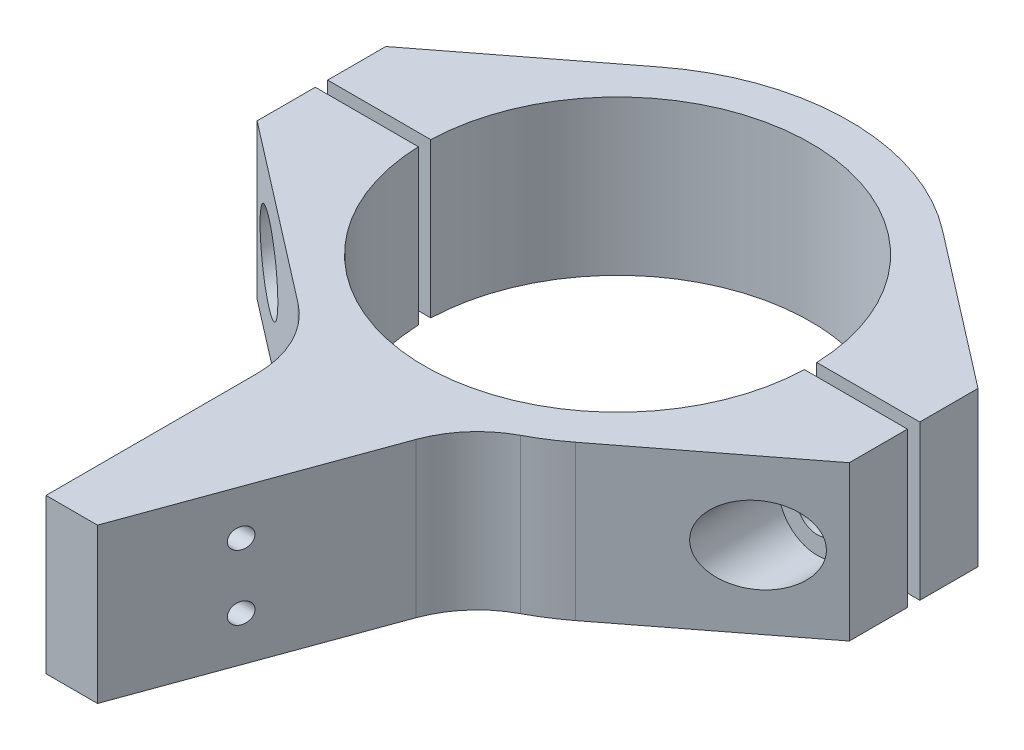
ISO-10303-21;
HEADER;
FILE_DESCRIPTION(('STEP AP214'),'2;1');
FILE_NAME('part.step','',(''),(''),'','','');
FILE_SCHEMA(('AUTOMOTIVE_DESIGN { 1 0 10303 214 1 1 1 1 }'));
ENDSEC;
DATA;
#1=APPLICATION_CONTEXT('core data for automotive mechanical design processes');
#2=APPLICATION_PROTOCOL_DEFINITION('international standard','automotive_design',2000,#1);
#3=PRODUCT_CONTEXT('',#1,'mechanical');
#4=PRODUCT('Part','Part','',(#3));
#5=PRODUCT_RELATED_PRODUCT_CATEGORY('part','',(#4));
#6=PRODUCT_DEFINITION_FORMATION('','',#4);
#7=PRODUCT_DEFINITION_CONTEXT('part definition',#1,'design');
#8=PRODUCT_DEFINITION('design','',#6,#7);
#9=PRODUCT_DEFINITION_SHAPE('','',#8);
#10=(LENGTH_UNIT() NAMED_UNIT(*) SI_UNIT(.MILLI.,.METRE.));
#11=(NAMED_UNIT(*) PLANE_ANGLE_UNIT() SI_UNIT($,.RADIAN.));
#12=(NAMED_UNIT(*) SI_UNIT($,.STERADIAN.) SOLID_ANGLE_UNIT());
#13=UNCERTAINTY_MEASURE_WITH_UNIT(LENGTH_MEASURE(1.E-05),#10,'distance_accuracy_value','');
#14=(GEOMETRIC_REPRESENTATION_CONTEXT(3) GLOBAL_UNCERTAINTY_ASSIGNED_CONTEXT((#13)) GLOBAL_UNIT_ASSIGNED_CONTEXT((#10,
#11,#12)) REPRESENTATION_CONTEXT('',''));
#15=CARTESIAN_POINT('',(0.,0.,0.));
#16=DIRECTION('',(0.,0.,1.));
#17=DIRECTION('',(1.,0.,0.));
#18=AXIS2_PLACEMENT_3D('',#15,#16,#17);
#19=CARTESIAN_POINT('',(0.,9.525,0.));
#20=DIRECTION('',(0.,1.,0.));
#21=DIRECTION('',(0.,0.,1.));
#22=AXIS2_PLACEMENT_3D('',#19,#20,#21);
#23=PLANE('',#22);
#24=DIRECTION('',(-1.,0.,0.));
#25=VECTOR('',#24,1.);
#26=CARTESIAN_POINT('',(0.,9.525,-0.762));
#27=LINE('',#26,#25);
#28=CARTESIAN_POINT('',(36.5125,9.52499999999999,-0.762));
#29=VERTEX_POINT('',#28);
#30=CARTESIAN_POINT('',(23.8003048772489,9.525,-0.762));
#31=VERTEX_POINT('',#30);
#32=EDGE_CURVE('E89',#29,#31,#27,.T.);
#33=ORIENTED_EDGE('',*,*,#32,.F.);
#34=DIRECTION('',(0.,0.,-1.));
#35=VECTOR('',#34,1.);
#36=CARTESIAN_POINT('',(36.5125,9.525,-7.9375));
#37=LINE('',#36,#35);
#38=CARTESIAN_POINT('',(36.5125,9.525,-7.9375));
#39=VERTEX_POINT('',#38);
#40=EDGE_CURVE('E158',#29,#39,#37,.T.);
#41=ORIENTED_EDGE('',*,*,#40,.T.);
#42=DIRECTION('',(-0.792079910516916,0.,-0.610417410757192));
#43=VECTOR('',#42,1.);
#44=CARTESIAN_POINT('',(17.4426775123868,9.525,-22.6336834430209));
#45=LINE('',#44,#43);
#46=CARTESIAN_POINT('',(17.4426775123868,9.525,-22.6336834430209));
#47=VERTEX_POINT('',#46);
#48=EDGE_CURVE('E159',#39,#47,#45,.T.);
#49=ORIENTED_EDGE('',*,*,#48,.T.);
#50=CARTESIAN_POINT('',(0.,9.525,0.));
#51=DIRECTION('',(0.,1.,0.));
#52=DIRECTION('',(0.,0.,1.));
#53=AXIS2_PLACEMENT_3D('',#50,#51,#52);
#54=CIRCLE('',#53,28.575);
#55=CARTESIAN_POINT('',(-17.4426775123868,9.525,-22.6336834430209));
#56=VERTEX_POINT('',#55);
#57=EDGE_CURVE('E165',#47,#56,#54,.T.);
#58=ORIENTED_EDGE('',*,*,#57,.T.);
#59=DIRECTION('',(-0.792079910516916,0.,0.610417410757192));
#60=VECTOR('',#59,1.);
#61=CARTESIAN_POINT('',(-17.4426775123868,9.525,-22.6336834430209));
#62=LINE('',#61,#60);
#63=CARTESIAN_POINT('',(-36.5125,9.525,-7.9375));
#64=VERTEX_POINT('',#63);
#65=EDGE_CURVE('E157',#56,#64,#62,.T.);
#66=ORIENTED_EDGE('',*,*,#65,.T.);
#67=DIRECTION('',(0.,0.,1.));
#68=VECTOR('',#67,1.);
#69=CARTESIAN_POINT('',(-36.5125,9.525,-7.9375));
#70=LINE('',#69,#68);
#71=CARTESIAN_POINT('',(-36.5125,9.525,-0.762));
#72=VERTEX_POINT('',#71);
#73=EDGE_CURVE('E156',#64,#72,#70,.T.);
#74=ORIENTED_EDGE('',*,*,#73,.T.);
#75=CARTESIAN_POINT('',(-23.8003048772489,9.525,-0.762));
#76=VERTEX_POINT('',#75);
#77=EDGE_CURVE('E121',#76,#72,#27,.T.);
#78=ORIENTED_EDGE('',*,*,#77,.F.);
#79=CARTESIAN_POINT('',(0.,9.525,0.));
#80=DIRECTION('',(0.,1.,0.));
#81=DIRECTION('',(0.,0.,1.));
#82=AXIS2_PLACEMENT_3D('',#79,#80,#81);
#83=CIRCLE('',#82,23.8125);
#84=EDGE_CURVE('E177',#31,#76,#83,.T.);
#85=ORIENTED_EDGE('',*,*,#84,.F.);
#86=EDGE_LOOP('',(#33,#41,#49,#58,#66,#74,#78,#85));
#87=FACE_BOUND('',#86,.T.);
#88=ADVANCED_FACE('F59',(#87),#23,.T.);
#89=CARTESIAN_POINT('',(0.,-9.525,0.));
#90=DIRECTION('',(0.,1.,0.));
#91=DIRECTION('',(0.,0.,1.));
#92=AXIS2_PLACEMENT_3D('',#89,#90,#91);
#93=PLANE('',#92);
#94=DIRECTION('',(0.,0.,1.));
#95=VECTOR('',#94,1.);
#96=CARTESIAN_POINT('',(36.5125,-9.525,-7.9375));
#97=LINE('',#96,#95);
#98=CARTESIAN_POINT('',(36.5125,-9.525,-7.9375));
#99=VERTEX_POINT('',#98);
#100=CARTESIAN_POINT('',(36.5125,-9.525,-0.762000000000001));
#101=VERTEX_POINT('',#100);
#102=EDGE_CURVE('E62',#99,#101,#97,.T.);
#103=ORIENTED_EDGE('',*,*,#102,.T.);
#104=DIRECTION('',(-1.,0.,0.));
#105=VECTOR('',#104,1.);
#106=CARTESIAN_POINT('',(-36.5125,-9.525,-0.762));
#107=LINE('',#106,#105);
#108=CARTESIAN_POINT('',(23.8003048772489,-9.525,-0.762));
#109=VERTEX_POINT('',#108);
#110=EDGE_CURVE('E145',#101,#109,#107,.T.);
#111=ORIENTED_EDGE('',*,*,#110,.T.);
#112=CARTESIAN_POINT('',(0.,-9.525,0.));
#113=DIRECTION('',(0.,1.,0.));
#114=DIRECTION('',(0.,0.,1.));
#115=AXIS2_PLACEMENT_3D('',#112,#113,#114);
#116=CIRCLE('',#115,23.8125);
#117=CARTESIAN_POINT('',(-23.8003048772489,-9.525,-0.762));
#118=VERTEX_POINT('',#117);
#119=EDGE_CURVE('E143',#109,#118,#116,.T.);
#120=ORIENTED_EDGE('',*,*,#119,.T.);
#121=CARTESIAN_POINT('',(-36.5125,-9.525,-0.762));
#122=VERTEX_POINT('',#121);
#123=EDGE_CURVE('E126',#118,#122,#107,.T.);
#124=ORIENTED_EDGE('',*,*,#123,.T.);
#125=DIRECTION('',(0.,0.,-1.));
#126=VECTOR('',#125,1.);
#127=CARTESIAN_POINT('',(-36.5125,-9.525,-7.9375));
#128=LINE('',#127,#126);
#129=CARTESIAN_POINT('',(-36.5125,-9.525,-7.9375));
#130=VERTEX_POINT('',#129);
#131=EDGE_CURVE('E140',#122,#130,#128,.T.);
#132=ORIENTED_EDGE('',*,*,#131,.T.);
#133=DIRECTION('',(0.792079910516916,0.,-0.610417410757192));
#134=VECTOR('',#133,1.);
#135=CARTESIAN_POINT('',(-17.4426775123868,-9.525,-22.6336834430209));
#136=LINE('',#135,#134);
#137=CARTESIAN_POINT('',(-17.4426775123868,-9.525,-22.6336834430209));
#138=VERTEX_POINT('',#137);
#139=EDGE_CURVE('E149',#130,#138,#136,.T.);
#140=ORIENTED_EDGE('',*,*,#139,.T.);
#141=CARTESIAN_POINT('',(0.,-9.525,0.));
#142=DIRECTION('',(0.,1.,0.));
#143=DIRECTION('',(0.,0.,1.));
#144=AXIS2_PLACEMENT_3D('',#141,#142,#143);
#145=CIRCLE('',#144,28.575);
#146=CARTESIAN_POINT('',(17.4426775123868,-9.525,-22.6336834430209));
#147=VERTEX_POINT('',#146);
#148=EDGE_CURVE('E182',#147,#138,#145,.T.);
#149=ORIENTED_EDGE('',*,*,#148,.F.);
#150=DIRECTION('',(0.792079910516916,0.,0.610417410757192));
#151=VECTOR('',#150,1.);
#152=CARTESIAN_POINT('',(17.4426775123868,-9.525,-22.6336834430209));
#153=LINE('',#152,#151);
#154=EDGE_CURVE('E151',#147,#99,#153,.T.);
#155=ORIENTED_EDGE('',*,*,#154,.T.);
#156=EDGE_LOOP('',(#103,#111,#120,#124,#132,#140,#149,#155));
#157=FACE_BOUND('',#156,.T.);
#158=ADVANCED_FACE('F138',(#157),#93,.F.);
#159=CARTESIAN_POINT('',(0.,9.525,0.));
#160=DIRECTION('',(0.,-1.,0.));
#161=DIRECTION('',(0.,0.,-1.));
#162=AXIS2_PLACEMENT_3D('',#159,#160,#161);
#163=CYLINDRICAL_SURFACE('',#162,23.8125);
#164=DIRECTION('',(0.,-1.,0.));
#165=VECTOR('',#164,1.);
#166=CARTESIAN_POINT('',(23.8003048772489,9.525,-0.762));
#167=LINE('',#166,#165);
#168=EDGE_CURVE('E68',#31,#109,#167,.T.);
#169=ORIENTED_EDGE('',*,*,#168,.F.);
#170=ORIENTED_EDGE('',*,*,#84,.T.);
#171=DIRECTION('',(0.,-1.,0.));
#172=VECTOR('',#171,1.);
#173=CARTESIAN_POINT('',(-23.8003048772489,9.525,-0.762));
#174=LINE('',#173,#172);
#175=EDGE_CURVE('E190',#118,#76,#174,.F.);
#176=ORIENTED_EDGE('',*,*,#175,.F.);
#177=ORIENTED_EDGE('',*,*,#119,.F.);
#178=EDGE_LOOP('',(#169,#170,#176,#177));
#179=FACE_BOUND('',#178,.T.);
#180=ADVANCED_FACE('F197',(#179),#163,.F.);
#181=CARTESIAN_POINT('',(36.5125,-58.6451856114631,-7.9375));
#182=DIRECTION('',(1.,0.,0.));
#183=DIRECTION('',(0.,0.,-1.));
#184=AXIS2_PLACEMENT_3D('',#181,#182,#183);
#185=PLANE('',#184);
#186=DIRECTION('',(0.,1.,0.));
#187=VECTOR('',#186,1.);
#188=CARTESIAN_POINT('',(36.5125,-9.525,-0.762));
#189=LINE('',#188,#187);
#190=EDGE_CURVE('E12',#101,#29,#189,.T.);
#191=ORIENTED_EDGE('',*,*,#190,.F.);
#192=ORIENTED_EDGE('',*,*,#102,.F.);
#193=DIRECTION('',(0.,1.,0.));
#194=VECTOR('',#193,1.);
#195=CARTESIAN_POINT('',(36.5125,-58.6451856114631,-7.9375));
#196=LINE('',#195,#194);
#197=EDGE_CURVE('E133',#99,#39,#196,.T.);
#198=ORIENTED_EDGE('',*,*,#197,.T.);
#199=ORIENTED_EDGE('',*,*,#40,.F.);
#200=EDGE_LOOP('',(#191,#192,#198,#199));
#201=FACE_BOUND('',#200,.T.);
#202=ADVANCED_FACE('F212',(#201),#185,.T.);
#203=CARTESIAN_POINT('',(-36.5125,-58.6451856114631,-7.9375));
#204=DIRECTION('',(-1.,0.,0.));
#205=DIRECTION('',(0.,0.,1.));
#206=AXIS2_PLACEMENT_3D('',#203,#204,#205);
#207=PLANE('',#206);
#208=DIRECTION('',(0.,1.,0.));
#209=VECTOR('',#208,1.);
#210=CARTESIAN_POINT('',(-36.5125,-9.525,-0.762));
#211=LINE('',#210,#209);
#212=EDGE_CURVE('E123',#122,#72,#211,.T.);
#213=ORIENTED_EDGE('',*,*,#212,.T.);
#214=ORIENTED_EDGE('',*,*,#73,.F.);
#215=DIRECTION('',(0.,1.,0.));
#216=VECTOR('',#215,1.);
#217=CARTESIAN_POINT('',(-36.5125,-58.6451856114631,-7.9375));
#218=LINE('',#217,#216);
#219=EDGE_CURVE('E147',#130,#64,#218,.T.);
#220=ORIENTED_EDGE('',*,*,#219,.F.);
#221=ORIENTED_EDGE('',*,*,#131,.F.);
#222=EDGE_LOOP('',(#213,#214,#220,#221));
#223=FACE_BOUND('',#222,.T.);
#224=ADVANCED_FACE('F146',(#223),#207,.T.);
#225=CARTESIAN_POINT('',(0.,9.525,0.));
#226=DIRECTION('',(0.,-1.,0.));
#227=DIRECTION('',(0.,0.,-1.));
#228=AXIS2_PLACEMENT_3D('',#225,#226,#227);
#229=CYLINDRICAL_SURFACE('',#228,28.575);
#230=DIRECTION('',(0.,1.,0.));
#231=VECTOR('',#230,1.);
#232=CARTESIAN_POINT('',(-17.4426775123868,-58.6451856114631,-22.6336834430209));
#233=LINE('',#232,#231);
#234=EDGE_CURVE('E132',#138,#56,#233,.T.);
#235=ORIENTED_EDGE('',*,*,#234,.T.);
#236=ORIENTED_EDGE('',*,*,#57,.F.);
#237=DIRECTION('',(0.,1.,0.));
#238=VECTOR('',#237,1.);
#239=CARTESIAN_POINT('',(17.4426775123868,-58.6451856114631,-22.6336834430209));
#240=LINE('',#239,#238);
#241=EDGE_CURVE('E179',#147,#47,#240,.T.);
#242=ORIENTED_EDGE('',*,*,#241,.F.);
#243=ORIENTED_EDGE('',*,*,#148,.T.);
#244=EDGE_LOOP('',(#235,#236,#242,#243));
#245=FACE_BOUND('',#244,.T.);
#246=ADVANCED_FACE('F206',(#245),#229,.T.);
#247=CARTESIAN_POINT('',(17.4426775123868,-58.6451856114631,-22.6336834430209));
#248=DIRECTION('',(0.610417410757192,0.,-0.792079910516916));
#249=DIRECTION('',(-0.792079910516916,0.,-0.610417410757192));
#250=AXIS2_PLACEMENT_3D('',#247,#248,#249);
#251=PLANE('',#250);
#252=CARTESIAN_POINT('',(30.1564024386245,0.,-12.8358348326597));
#253=DIRECTION('',(-0.610417410757192,0.,0.792079910516916));
#254=DIRECTION('',(0.792079910516916,0.,0.610417410757192));
#255=AXIS2_PLACEMENT_3D('',#252,#253,#254);
#256=ELLIPSE('',#255,4.00843394440844,3.175);
#257=CARTESIAN_POINT('',(33.3314024386245,0.,-10.3890169631226));
#258=VERTEX_POINT('',#257);
#259=EDGE_CURVE('E258',#258,#258,#256,.T.);
#260=ORIENTED_EDGE('',*,*,#259,.T.);
#261=EDGE_LOOP('',(#260));
#262=FACE_BOUND('',#261,.T.);
#263=ORIENTED_EDGE('',*,*,#154,.F.);
#264=ORIENTED_EDGE('',*,*,#241,.T.);
#265=ORIENTED_EDGE('',*,*,#48,.F.);
#266=ORIENTED_EDGE('',*,*,#197,.F.);
#267=EDGE_LOOP('',(#263,#264,#265,#266));
#268=FACE_BOUND('',#267,.T.);
#269=ADVANCED_FACE('F210',(#262,#268),#251,.T.);
#270=CARTESIAN_POINT('',(-17.4426775123868,-58.6451856114631,-22.6336834430209));
#271=DIRECTION('',(-0.610417410757192,0.,-0.792079910516916));
#272=DIRECTION('',(-0.792079910516916,0.,0.610417410757192));
#273=AXIS2_PLACEMENT_3D('',#270,#271,#272);
#274=PLANE('',#273);
#275=CARTESIAN_POINT('',(-30.1564024386245,0.,-12.8358348326597));
#276=DIRECTION('',(-0.610417410757192,0.,-0.792079910516916));
#277=DIRECTION('',(-0.792079910516916,0.,0.610417410757192));
#278=AXIS2_PLACEMENT_3D('',#275,#276,#277);
#279=ELLIPSE('',#278,4.00843394440844,3.175);
#280=CARTESIAN_POINT('',(-33.3314024386245,0.,-10.3890169631226));
#281=VERTEX_POINT('',#280);
#282=EDGE_CURVE('E160',#281,#281,#279,.T.);
#283=ORIENTED_EDGE('',*,*,#282,.F.);
#284=EDGE_LOOP('',(#283));
#285=FACE_BOUND('',#284,.T.);
#286=ORIENTED_EDGE('',*,*,#139,.F.);
#287=ORIENTED_EDGE('',*,*,#219,.T.);
#288=ORIENTED_EDGE('',*,*,#65,.F.);
#289=ORIENTED_EDGE('',*,*,#234,.F.);
#290=EDGE_LOOP('',(#286,#287,#288,#289));
#291=FACE_BOUND('',#290,.T.);
#292=ADVANCED_FACE('F201',(#285,#291),#274,.T.);
#293=CARTESIAN_POINT('',(-36.5125,-9.525,-0.762));
#294=DIRECTION('',(0.,0.,-1.));
#295=DIRECTION('',(-1.,0.,0.));
#296=AXIS2_PLACEMENT_3D('',#293,#294,#295);
#297=PLANE('',#296);
#298=CARTESIAN_POINT('',(-30.1564024386245,0.,-0.761999999999999));
#299=DIRECTION('',(0.,0.,1.));
#300=DIRECTION('',(1.,0.,0.));
#301=AXIS2_PLACEMENT_3D('',#298,#299,#300);
#302=CIRCLE('',#301,3.175);
#303=CARTESIAN_POINT('',(-26.9814024386245,0.,-0.761999999999999));
#304=VERTEX_POINT('',#303);
#305=EDGE_CURVE('E168',#304,#304,#302,.T.);
#306=ORIENTED_EDGE('',*,*,#305,.F.);
#307=EDGE_LOOP('',(#306));
#308=FACE_BOUND('',#307,.T.);
#309=ORIENTED_EDGE('',*,*,#77,.T.);
#310=ORIENTED_EDGE('',*,*,#212,.F.);
#311=ORIENTED_EDGE('',*,*,#123,.F.);
#312=ORIENTED_EDGE('',*,*,#175,.T.);
#313=EDGE_LOOP('',(#309,#310,#311,#312));
#314=FACE_BOUND('',#313,.T.);
#315=ADVANCED_FACE('F125',(#308,#314),#297,.F.);
#316=CARTESIAN_POINT('',(30.1564024386245,0.,-0.761999999999999));
#317=DIRECTION('',(0.,0.,-1.));
#318=DIRECTION('',(-1.,0.,0.));
#319=AXIS2_PLACEMENT_3D('',#316,#317,#318);
#320=CIRCLE('',#319,3.175);
#321=CARTESIAN_POINT('',(26.9814024386245,0.,-0.761999999999999));
#322=VERTEX_POINT('',#321);
#323=EDGE_CURVE('E173',#322,#322,#320,.T.);
#324=ORIENTED_EDGE('',*,*,#323,.T.);
#325=EDGE_LOOP('',(#324));
#326=FACE_BOUND('',#325,.T.);
#327=ORIENTED_EDGE('',*,*,#32,.T.);
#328=ORIENTED_EDGE('',*,*,#168,.T.);
#329=ORIENTED_EDGE('',*,*,#110,.F.);
#330=ORIENTED_EDGE('',*,*,#190,.T.);
#331=EDGE_LOOP('',(#327,#328,#329,#330));
#332=FACE_BOUND('',#331,.T.);
#333=ADVANCED_FACE('F213',(#326,#332),#297,.F.);
#334=CARTESIAN_POINT('',(-30.1564024386245,0.,-15.2826527021967));
#335=DIRECTION('',(0.,0.,1.));
#336=DIRECTION('',(1.,0.,0.));
#337=AXIS2_PLACEMENT_3D('',#334,#335,#336);
#338=CYLINDRICAL_SURFACE('',#337,3.175);
#339=ORIENTED_EDGE('',*,*,#282,.T.);
#340=EDGE_LOOP('',(#339));
#341=FACE_BOUND('',#340,.T.);
#342=ORIENTED_EDGE('',*,*,#305,.T.);
#343=EDGE_LOOP('',(#342));
#344=FACE_BOUND('',#343,.T.);
#345=ADVANCED_FACE('F215',(#341,#344),#338,.F.);
#346=CARTESIAN_POINT('',(30.1564024386245,0.,-15.2826527021967));
#347=DIRECTION('',(0.,0.,1.));
#348=DIRECTION('',(-1.,0.,0.));
#349=AXIS2_PLACEMENT_3D('',#346,#347,#348);
#350=CYLINDRICAL_SURFACE('',#349,3.175);
#351=ORIENTED_EDGE('',*,*,#259,.F.);
#352=EDGE_LOOP('',(#351));
#353=FACE_BOUND('',#352,.T.);
#354=ORIENTED_EDGE('',*,*,#323,.F.);
#355=EDGE_LOOP('',(#354));
#356=FACE_BOUND('',#355,.T.);
#357=ADVANCED_FACE('F223',(#353,#356),#350,.F.);
#358=CLOSED_SHELL('',(#88,#158,#180,#202,#224,#246,#269,#292,#315,#333,#345,#357));
#359=MANIFOLD_SOLID_BREP('B2',#358);
#360=CARTESIAN_POINT('',(0.,9.525,0.));
#361=DIRECTION('',(0.,-1.,0.));
#362=DIRECTION('',(0.,0.,-1.));
#363=AXIS2_PLACEMENT_3D('',#360,#361,#362);
#364=CYLINDRICAL_SURFACE('',#363,28.575);
#365=CARTESIAN_POINT('',(0.,9.525,0.));
#366=DIRECTION('',(0.,1.,0.));
#367=DIRECTION('',(0.,0.,1.));
#368=AXIS2_PLACEMENT_3D('',#365,#366,#367);
#369=CIRCLE('',#368,28.575);
#370=CARTESIAN_POINT('',(13.3172571291354,9.525,25.2820348776852));
#371=VERTEX_POINT('',#370);
#372=CARTESIAN_POINT('',(17.4426775123868,9.525,22.6336834430209));
#373=VERTEX_POINT('',#372);
#374=EDGE_CURVE('E545',#371,#373,#369,.T.);
#375=ORIENTED_EDGE('',*,*,#374,.F.);
#376=DIRECTION('',(0.,-1.,0.));
#377=VECTOR('',#376,1.);
#378=CARTESIAN_POINT('',(13.3172571291354,9.525,25.2820348776852));
#379=LINE('',#378,#377);
#380=CARTESIAN_POINT('',(13.3172571291354,-9.525,25.2820348776852));
#381=VERTEX_POINT('',#380);
#382=EDGE_CURVE('E353',#371,#381,#379,.T.);
#383=ORIENTED_EDGE('',*,*,#382,.T.);
#384=CARTESIAN_POINT('',(0.,-9.525,0.));
#385=DIRECTION('',(0.,1.,0.));
#386=DIRECTION('',(0.,0.,1.));
#387=AXIS2_PLACEMENT_3D('',#384,#385,#386);
#388=CIRCLE('',#387,28.575);
#389=CARTESIAN_POINT('',(17.4426775123868,-9.525,22.6336834430209));
#390=VERTEX_POINT('',#389);
#391=EDGE_CURVE('E542',#381,#390,#388,.T.);
#392=ORIENTED_EDGE('',*,*,#391,.T.);
#393=DIRECTION('',(0.,1.,0.));
#394=VECTOR('',#393,1.);
#395=CARTESIAN_POINT('',(17.4426775123868,-58.6451856114631,22.6336834430209));
#396=LINE('',#395,#394);
#397=EDGE_CURVE('E528',#390,#373,#396,.T.);
#398=ORIENTED_EDGE('',*,*,#397,.T.);
#399=EDGE_LOOP('',(#375,#383,#392,#398));
#400=FACE_BOUND('',#399,.T.);
#401=ADVANCED_FACE('F338',(#400),#364,.T.);
#402=CARTESIAN_POINT('',(36.5125,-58.6451856114631,7.9375));
#403=DIRECTION('',(0.610417410757192,0.,0.792079910516916));
#404=DIRECTION('',(0.792079910516916,0.,-0.610417410757192));
#405=AXIS2_PLACEMENT_3D('',#402,#403,#404);
#406=PLANE('',#405);
#407=CARTESIAN_POINT('',(30.1564024386245,0.,12.8358348326597));
#408=DIRECTION('',(-0.610417410757192,0.,-0.792079910516916));
#409=DIRECTION('',(-0.792079910516916,0.,0.610417410757192));
#410=AXIS2_PLACEMENT_3D('',#407,#408,#409);
#411=ELLIPSE('',#410,6.01265091661265,4.7625);
#412=CARTESIAN_POINT('',(25.3939024386245,0.,16.5060616369652));
#413=VERTEX_POINT('',#412);
#414=EDGE_CURVE('E481',#413,#413,#411,.T.);
#415=ORIENTED_EDGE('',*,*,#414,.T.);
#416=EDGE_LOOP('',(#415));
#417=FACE_BOUND('',#416,.T.);
#418=DIRECTION('',(-0.792079910516916,0.,0.610417410757192));
#419=VECTOR('',#418,1.);
#420=CARTESIAN_POINT('',(36.5125,-9.525,7.9375));
#421=LINE('',#420,#419);
#422=CARTESIAN_POINT('',(36.5125,-9.525,7.9375));
#423=VERTEX_POINT('',#422);
#424=EDGE_CURVE('E524',#423,#390,#421,.T.);
#425=ORIENTED_EDGE('',*,*,#424,.F.);
#426=DIRECTION('',(0.,1.,0.));
#427=VECTOR('',#426,1.);
#428=CARTESIAN_POINT('',(36.5125,-58.6451856114631,7.9375));
#429=LINE('',#428,#427);
#430=CARTESIAN_POINT('',(36.5125,9.525,7.9375));
#431=VERTEX_POINT('',#430);
#432=EDGE_CURVE('E532',#423,#431,#429,.T.);
#433=ORIENTED_EDGE('',*,*,#432,.T.);
#434=DIRECTION('',(0.792079910516916,0.,-0.610417410757192));
#435=VECTOR('',#434,1.);
#436=CARTESIAN_POINT('',(36.5125,9.525,7.9375));
#437=LINE('',#436,#435);
#438=EDGE_CURVE('E521',#373,#431,#437,.T.);
#439=ORIENTED_EDGE('',*,*,#438,.F.);
#440=ORIENTED_EDGE('',*,*,#397,.F.);
#441=EDGE_LOOP('',(#425,#433,#439,#440));
#442=FACE_BOUND('',#441,.T.);
#443=ADVANCED_FACE('F615',(#417,#442),#406,.T.);
#444=CARTESIAN_POINT('',(-36.5125,-58.6451856114631,7.9375));
#445=DIRECTION('',(-0.610417410757192,0.,0.792079910516916));
#446=DIRECTION('',(0.792079910516916,0.,0.610417410757192));
#447=AXIS2_PLACEMENT_3D('',#444,#445,#446);
#448=PLANE('',#447);
#449=CARTESIAN_POINT('',(-30.1564024386245,0.,12.8358348326597));
#450=DIRECTION('',(-0.610417410757192,0.,0.792079910516916));
#451=DIRECTION('',(0.792079910516916,0.,0.610417410757192));
#452=AXIS2_PLACEMENT_3D('',#449,#450,#451);
#453=ELLIPSE('',#452,6.01265091661265,4.7625);
#454=CARTESIAN_POINT('',(-25.3939024386245,0.,16.5060616369652));
#455=VERTEX_POINT('',#454);
#456=EDGE_CURVE('E499',#455,#455,#453,.T.);
#457=ORIENTED_EDGE('',*,*,#456,.F.);
#458=EDGE_LOOP('',(#457));
#459=FACE_BOUND('',#458,.T.);
#460=DIRECTION('',(-0.792079910516916,0.,-0.610417410757192));
#461=VECTOR('',#460,1.);
#462=CARTESIAN_POINT('',(-36.5125,-9.525,7.9375));
#463=LINE('',#462,#461);
#464=CARTESIAN_POINT('',(-14.4726988833837,-9.525,24.9225013269856));
#465=VERTEX_POINT('',#464);
#466=CARTESIAN_POINT('',(-36.5125,-9.525,7.9375));
#467=VERTEX_POINT('',#466);
#468=EDGE_CURVE('E447',#465,#467,#463,.T.);
#469=ORIENTED_EDGE('',*,*,#468,.F.);
#470=DIRECTION('',(0.,1.,0.));
#471=VECTOR('',#470,1.);
#472=CARTESIAN_POINT('',(-14.4726988833837,-56.1798095789794,24.9225013269856));
#473=LINE('',#472,#471);
#474=CARTESIAN_POINT('',(-14.4726988833837,9.525,24.9225013269856));
#475=VERTEX_POINT('',#474);
#476=EDGE_CURVE('E445',#465,#475,#473,.T.);
#477=ORIENTED_EDGE('',*,*,#476,.T.);
#478=DIRECTION('',(0.792079910516916,0.,0.610417410757192));
#479=VECTOR('',#478,1.);
#480=CARTESIAN_POINT('',(-36.5125,9.525,7.9375));
#481=LINE('',#480,#479);
#482=CARTESIAN_POINT('',(-36.5125,9.525,7.9375));
#483=VERTEX_POINT('',#482);
#484=EDGE_CURVE('E430',#483,#475,#481,.T.);
#485=ORIENTED_EDGE('',*,*,#484,.F.);
#486=DIRECTION('',(0.,1.,0.));
#487=VECTOR('',#486,1.);
#488=CARTESIAN_POINT('',(-36.5125,-58.6451856114631,7.9375));
#489=LINE('',#488,#487);
#490=EDGE_CURVE('E442',#467,#483,#489,.T.);
#491=ORIENTED_EDGE('',*,*,#490,.F.);
#492=EDGE_LOOP('',(#469,#477,#485,#491));
#493=FACE_BOUND('',#492,.T.);
#494=ADVANCED_FACE('F446',(#459,#493),#448,.T.);
#495=CARTESIAN_POINT('',(36.5125,-58.6451856114631,-7.9375));
#496=DIRECTION('',(1.,0.,0.));
#497=DIRECTION('',(0.,0.,-1.));
#498=AXIS2_PLACEMENT_3D('',#495,#496,#497);
#499=PLANE('',#498);
#500=DIRECTION('',(0.,1.,0.));
#501=VECTOR('',#500,1.);
#502=CARTESIAN_POINT('',(36.5125,-9.525,0.762));
#503=LINE('',#502,#501);
#504=CARTESIAN_POINT('',(36.5125,-9.525,0.762));
#505=VERTEX_POINT('',#504);
#506=CARTESIAN_POINT('',(36.5125,9.525,0.762000000000001));
#507=VERTEX_POINT('',#506);
#508=EDGE_CURVE('E505',#505,#507,#503,.T.);
#509=ORIENTED_EDGE('',*,*,#508,.T.);
#510=DIRECTION('',(0.,0.,-1.));
#511=VECTOR('',#510,1.);
#512=CARTESIAN_POINT('',(36.5125,9.525,-7.9375));
#513=LINE('',#512,#511);
#514=EDGE_CURVE('E531',#431,#507,#513,.T.);
#515=ORIENTED_EDGE('',*,*,#514,.F.);
#516=ORIENTED_EDGE('',*,*,#432,.F.);
#517=DIRECTION('',(0.,0.,1.));
#518=VECTOR('',#517,1.);
#519=CARTESIAN_POINT('',(36.5125,-9.525,-7.9375));
#520=LINE('',#519,#518);
#521=EDGE_CURVE('E527',#505,#423,#520,.T.);
#522=ORIENTED_EDGE('',*,*,#521,.F.);
#523=EDGE_LOOP('',(#509,#515,#516,#522));
#524=FACE_BOUND('',#523,.T.);
#525=ADVANCED_FACE('F609',(#524),#499,.T.);
#526=CARTESIAN_POINT('',(0.,9.525,0.));
#527=DIRECTION('',(0.,-1.,0.));
#528=DIRECTION('',(0.,0.,-1.));
#529=AXIS2_PLACEMENT_3D('',#526,#527,#528);
#530=CYLINDRICAL_SURFACE('',#529,23.8125);
#531=DIRECTION('',(0.,-1.,0.));
#532=VECTOR('',#531,1.);
#533=CARTESIAN_POINT('',(-23.8003048772489,9.525,0.762));
#534=LINE('',#533,#532);
#535=CARTESIAN_POINT('',(-23.8003048772489,9.525,0.762));
#536=VERTEX_POINT('',#535);
#537=CARTESIAN_POINT('',(-23.8003048772489,-9.525,0.762));
#538=VERTEX_POINT('',#537);
#539=EDGE_CURVE('E513',#536,#538,#534,.T.);
#540=ORIENTED_EDGE('',*,*,#539,.F.);
#541=CARTESIAN_POINT('',(0.,9.525,0.));
#542=DIRECTION('',(0.,1.,0.));
#543=DIRECTION('',(0.,0.,1.));
#544=AXIS2_PLACEMENT_3D('',#541,#542,#543);
#545=CIRCLE('',#544,23.8125);
#546=CARTESIAN_POINT('',(23.8003048772489,9.525,0.762));
#547=VERTEX_POINT('',#546);
#548=EDGE_CURVE('E539',#536,#547,#545,.T.);
#549=ORIENTED_EDGE('',*,*,#548,.T.);
#550=DIRECTION('',(0.,-1.,0.));
#551=VECTOR('',#550,1.);
#552=CARTESIAN_POINT('',(23.8003048772489,9.525,0.762));
#553=LINE('',#552,#551);
#554=CARTESIAN_POINT('',(23.8003048772489,-9.525,0.762));
#555=VERTEX_POINT('',#554);
#556=EDGE_CURVE('E508',#555,#547,#553,.F.);
#557=ORIENTED_EDGE('',*,*,#556,.F.);
#558=CARTESIAN_POINT('',(0.,-9.525,0.));
#559=DIRECTION('',(0.,1.,0.));
#560=DIRECTION('',(0.,0.,1.));
#561=AXIS2_PLACEMENT_3D('',#558,#559,#560);
#562=CIRCLE('',#561,23.8125);
#563=EDGE_CURVE('E520',#538,#555,#562,.T.);
#564=ORIENTED_EDGE('',*,*,#563,.F.);
#565=EDGE_LOOP('',(#540,#549,#557,#564));
#566=FACE_BOUND('',#565,.T.);
#567=ADVANCED_FACE('F602',(#566),#530,.F.);
#568=CARTESIAN_POINT('',(-36.5125,-58.6451856114631,-7.9375));
#569=DIRECTION('',(-1.,0.,0.));
#570=DIRECTION('',(0.,0.,1.));
#571=AXIS2_PLACEMENT_3D('',#568,#569,#570);
#572=PLANE('',#571);
#573=DIRECTION('',(0.,1.,0.));
#574=VECTOR('',#573,1.);
#575=CARTESIAN_POINT('',(-36.5125,-9.525,0.762));
#576=LINE('',#575,#574);
#577=CARTESIAN_POINT('',(-36.5125,-9.525,0.762000000000001));
#578=VERTEX_POINT('',#577);
#579=CARTESIAN_POINT('',(-36.5125,9.52499999999999,0.762));
#580=VERTEX_POINT('',#579);
#581=EDGE_CURVE('E503',#578,#580,#576,.T.);
#582=ORIENTED_EDGE('',*,*,#581,.F.);
#583=DIRECTION('',(0.,0.,-1.));
#584=VECTOR('',#583,1.);
#585=CARTESIAN_POINT('',(-36.5125,-9.525,-7.9375));
#586=LINE('',#585,#584);
#587=EDGE_CURVE('E516',#467,#578,#586,.T.);
#588=ORIENTED_EDGE('',*,*,#587,.F.);
#589=ORIENTED_EDGE('',*,*,#490,.T.);
#590=DIRECTION('',(0.,0.,1.));
#591=VECTOR('',#590,1.);
#592=CARTESIAN_POINT('',(-36.5125,9.525,-7.9375));
#593=LINE('',#592,#591);
#594=EDGE_CURVE('E438',#580,#483,#593,.T.);
#595=ORIENTED_EDGE('',*,*,#594,.F.);
#596=EDGE_LOOP('',(#582,#588,#589,#595));
#597=FACE_BOUND('',#596,.T.);
#598=ADVANCED_FACE('F594',(#597),#572,.T.);
#599=CARTESIAN_POINT('',(0.,-9.525,0.));
#600=DIRECTION('',(0.,1.,0.));
#601=DIRECTION('',(0.,0.,1.));
#602=AXIS2_PLACEMENT_3D('',#599,#600,#601);
#603=PLANE('',#602);
#604=ORIENTED_EDGE('',*,*,#587,.T.);
#605=DIRECTION('',(1.,0.,0.));
#606=VECTOR('',#605,1.);
#607=CARTESIAN_POINT('',(-36.5125,-9.525,0.762));
#608=LINE('',#607,#606);
#609=EDGE_CURVE('E500',#578,#538,#608,.T.);
#610=ORIENTED_EDGE('',*,*,#609,.T.);
#611=ORIENTED_EDGE('',*,*,#563,.T.);
#612=EDGE_CURVE('E504',#555,#505,#608,.T.);
#613=ORIENTED_EDGE('',*,*,#612,.T.);
#614=ORIENTED_EDGE('',*,*,#521,.T.);
#615=ORIENTED_EDGE('',*,*,#424,.T.);
#616=ORIENTED_EDGE('',*,*,#391,.F.);
#617=CARTESIAN_POINT('',(19.2360380754178,-9.525,36.5184948233231));
#618=DIRECTION('',(0.,1.,0.));
#619=DIRECTION('',(0.,0.,1.));
#620=AXIS2_PLACEMENT_3D('',#617,#618,#619);
#621=CIRCLE('',#620,12.7);
#622=CARTESIAN_POINT('',(7.30194179143675,-9.525,32.1748390030871));
#623=VERTEX_POINT('',#622);
#624=EDGE_CURVE('E57',#381,#623,#621,.T.);
#625=ORIENTED_EDGE('',*,*,#624,.T.);
#626=DIRECTION('',(-0.342020143325669,0.,0.939692620785908));
#627=VECTOR('',#626,1.);
#628=CARTESIAN_POINT('',(9.16117025490158,-9.525,27.0666507821102));
#629=LINE('',#628,#627);
#630=CARTESIAN_POINT('',(-3.175,-9.525,60.96));
#631=VERTEX_POINT('',#630);
#632=EDGE_CURVE('E466',#623,#631,#629,.T.);
#633=ORIENTED_EDGE('',*,*,#632,.T.);
#634=DIRECTION('',(-1.,0.,0.));
#635=VECTOR('',#634,1.);
#636=CARTESIAN_POINT('',(-3.175,-9.525,60.96));
#637=LINE('',#636,#635);
#638=CARTESIAN_POINT('',(-9.525,-9.525,60.96));
#639=VERTEX_POINT('',#638);
#640=EDGE_CURVE('E566',#631,#639,#637,.T.);
#641=ORIENTED_EDGE('',*,*,#640,.T.);
#642=DIRECTION('',(0.,0.,-1.));
#643=VECTOR('',#642,1.);
#644=CARTESIAN_POINT('',(-9.525,-9.525,60.96));
#645=LINE('',#644,#643);
#646=CARTESIAN_POINT('',(-9.525,-9.525,34.9819161905504));
#647=VERTEX_POINT('',#646);
#648=EDGE_CURVE('E569',#639,#647,#645,.T.);
#649=ORIENTED_EDGE('',*,*,#648,.T.);
#650=CARTESIAN_POINT('',(-22.225,-9.525,34.9819161905504));
#651=DIRECTION('',(0.,1.,0.));
#652=DIRECTION('',(0.,0.,1.));
#653=AXIS2_PLACEMENT_3D('',#650,#651,#652);
#654=CIRCLE('',#653,12.7);
#655=EDGE_CURVE('E474',#647,#465,#654,.T.);
#656=ORIENTED_EDGE('',*,*,#655,.T.);
#657=ORIENTED_EDGE('',*,*,#468,.T.);
#658=EDGE_LOOP('',(#604,#610,#611,#613,#614,#615,#616,#625,#633,#641,#649,#656,#657));
#659=FACE_BOUND('',#658,.T.);
#660=ADVANCED_FACE('F590',(#659),#603,.F.);
#661=CARTESIAN_POINT('',(0.,9.525,0.));
#662=DIRECTION('',(0.,1.,0.));
#663=DIRECTION('',(0.,0.,1.));
#664=AXIS2_PLACEMENT_3D('',#661,#662,#663);
#665=PLANE('',#664);
#666=DIRECTION('',(1.,0.,0.));
#667=VECTOR('',#666,1.);
#668=CARTESIAN_POINT('',(0.,9.525,0.762));
#669=LINE('',#668,#667);
#670=EDGE_CURVE('E514',#580,#536,#669,.T.);
#671=ORIENTED_EDGE('',*,*,#670,.F.);
#672=ORIENTED_EDGE('',*,*,#594,.T.);
#673=ORIENTED_EDGE('',*,*,#484,.T.);
#674=CARTESIAN_POINT('',(-22.225,9.525,34.9819161905504));
#675=DIRECTION('',(0.,-1.,0.));
#676=DIRECTION('',(0.,0.,1.));
#677=AXIS2_PLACEMENT_3D('',#674,#675,#676);
#678=CIRCLE('',#677,12.7);
#679=CARTESIAN_POINT('',(-9.525,9.525,34.9819161905504));
#680=VERTEX_POINT('',#679);
#681=EDGE_CURVE('E436',#475,#680,#678,.T.);
#682=ORIENTED_EDGE('',*,*,#681,.T.);
#683=DIRECTION('',(0.,0.,1.));
#684=VECTOR('',#683,1.);
#685=CARTESIAN_POINT('',(-9.525,9.525,60.96));
#686=LINE('',#685,#684);
#687=CARTESIAN_POINT('',(-9.525,9.525,60.96));
#688=VERTEX_POINT('',#687);
#689=EDGE_CURVE('E457',#680,#688,#686,.T.);
#690=ORIENTED_EDGE('',*,*,#689,.T.);
#691=DIRECTION('',(1.,0.,0.));
#692=VECTOR('',#691,1.);
#693=CARTESIAN_POINT('',(-3.175,9.525,60.96));
#694=LINE('',#693,#692);
#695=CARTESIAN_POINT('',(-3.175,9.525,60.96));
#696=VERTEX_POINT('',#695);
#697=EDGE_CURVE('E460',#688,#696,#694,.T.);
#698=ORIENTED_EDGE('',*,*,#697,.T.);
#699=DIRECTION('',(0.342020143325669,0.,-0.939692620785908));
#700=VECTOR('',#699,1.);
#701=CARTESIAN_POINT('',(9.16117025490158,9.525,27.0666507821102));
#702=LINE('',#701,#700);
#703=CARTESIAN_POINT('',(7.30194179143675,9.525,32.1748390030871));
#704=VERTEX_POINT('',#703);
#705=EDGE_CURVE('E452',#696,#704,#702,.T.);
#706=ORIENTED_EDGE('',*,*,#705,.T.);
#707=CARTESIAN_POINT('',(19.2360380754178,9.525,36.5184948233231));
#708=DIRECTION('',(0.,1.,0.));
#709=DIRECTION('',(0.,0.,1.));
#710=AXIS2_PLACEMENT_3D('',#707,#708,#709);
#711=CIRCLE('',#710,12.7);
#712=EDGE_CURVE('E346',#704,#371,#711,.F.);
#713=ORIENTED_EDGE('',*,*,#712,.T.);
#714=ORIENTED_EDGE('',*,*,#374,.T.);
#715=ORIENTED_EDGE('',*,*,#438,.T.);
#716=ORIENTED_EDGE('',*,*,#514,.T.);
#717=EDGE_CURVE('E511',#547,#507,#669,.T.);
#718=ORIENTED_EDGE('',*,*,#717,.F.);
#719=ORIENTED_EDGE('',*,*,#548,.F.);
#720=EDGE_LOOP('',(#671,#672,#673,#682,#690,#698,#706,#713,#714,#715,#716,#718,#719));
#721=FACE_BOUND('',#720,.T.);
#722=ADVANCED_FACE('F433',(#721),#665,.T.);
#723=CARTESIAN_POINT('',(-36.5125,-9.525,0.762));
#724=DIRECTION('',(0.,0.,1.));
#725=DIRECTION('',(1.,0.,0.));
#726=AXIS2_PLACEMENT_3D('',#723,#724,#725);
#727=PLANE('',#726);
#728=CARTESIAN_POINT('',(-30.1564024386245,0.,0.761999999999999));
#729=DIRECTION('',(0.,0.,1.));
#730=DIRECTION('',(1.,0.,0.));
#731=AXIS2_PLACEMENT_3D('',#728,#729,#730);
#732=CIRCLE('',#731,2.55270000000001);
#733=CARTESIAN_POINT('',(-27.6037024386245,0.,0.761999999999999));
#734=VERTEX_POINT('',#733);
#735=EDGE_CURVE('E490',#734,#734,#732,.T.);
#736=ORIENTED_EDGE('',*,*,#735,.T.);
#737=EDGE_LOOP('',(#736));
#738=FACE_BOUND('',#737,.T.);
#739=ORIENTED_EDGE('',*,*,#670,.T.);
#740=ORIENTED_EDGE('',*,*,#539,.T.);
#741=ORIENTED_EDGE('',*,*,#609,.F.);
#742=ORIENTED_EDGE('',*,*,#581,.T.);
#743=EDGE_LOOP('',(#739,#740,#741,#742));
#744=FACE_BOUND('',#743,.T.);
#745=ADVANCED_FACE('F596',(#738,#744),#727,.F.);
#746=CARTESIAN_POINT('',(30.1564024386245,0.,0.761999999999999));
#747=DIRECTION('',(0.,0.,-1.));
#748=DIRECTION('',(-1.,0.,0.));
#749=AXIS2_PLACEMENT_3D('',#746,#747,#748);
#750=CIRCLE('',#749,2.55270000000001);
#751=CARTESIAN_POINT('',(27.6037024386245,0.,0.761999999999999));
#752=VERTEX_POINT('',#751);
#753=EDGE_CURVE('E478',#752,#752,#750,.T.);
#754=ORIENTED_EDGE('',*,*,#753,.F.);
#755=EDGE_LOOP('',(#754));
#756=FACE_BOUND('',#755,.T.);
#757=ORIENTED_EDGE('',*,*,#717,.T.);
#758=ORIENTED_EDGE('',*,*,#508,.F.);
#759=ORIENTED_EDGE('',*,*,#612,.F.);
#760=ORIENTED_EDGE('',*,*,#556,.T.);
#761=EDGE_LOOP('',(#757,#758,#759,#760));
#762=FACE_BOUND('',#761,.T.);
#763=ADVANCED_FACE('F645',(#756,#762),#727,.F.);
#764=CARTESIAN_POINT('',(-30.1564024386245,0.,-15.2826527021967));
#765=DIRECTION('',(0.,0.,1.));
#766=DIRECTION('',(1.,0.,0.));
#767=AXIS2_PLACEMENT_3D('',#764,#765,#766);
#768=CYLINDRICAL_SURFACE('',#767,4.7625);
#769=ORIENTED_EDGE('',*,*,#456,.T.);
#770=EDGE_LOOP('',(#769));
#771=FACE_BOUND('',#770,.T.);
#772=CARTESIAN_POINT('',(-30.1564024386245,0.,5.5245));
#773=DIRECTION('',(0.,0.,1.));
#774=DIRECTION('',(1.,0.,0.));
#775=AXIS2_PLACEMENT_3D('',#772,#773,#774);
#776=CIRCLE('',#775,4.7625);
#777=CARTESIAN_POINT('',(-25.3939024386245,0.,5.5245));
#778=VERTEX_POINT('',#777);
#779=EDGE_CURVE('E496',#778,#778,#776,.T.);
#780=ORIENTED_EDGE('',*,*,#779,.F.);
#781=EDGE_LOOP('',(#780));
#782=FACE_BOUND('',#781,.T.);
#783=ADVANCED_FACE('F648',(#771,#782),#768,.F.);
#784=CARTESIAN_POINT('',(-27.6037024386245,0.,5.5245));
#785=DIRECTION('',(0.,0.,-1.));
#786=DIRECTION('',(-1.,0.,0.));
#787=AXIS2_PLACEMENT_3D('',#784,#785,#786);
#788=PLANE('',#787);
#789=CARTESIAN_POINT('',(-30.1564024386245,0.,5.5245));
#790=DIRECTION('',(0.,0.,1.));
#791=DIRECTION('',(1.,0.,0.));
#792=AXIS2_PLACEMENT_3D('',#789,#790,#791);
#793=CIRCLE('',#792,2.5527);
#794=CARTESIAN_POINT('',(-27.6037024386245,0.,5.5245));
#795=VERTEX_POINT('',#794);
#796=EDGE_CURVE('E493',#795,#795,#793,.T.);
#797=ORIENTED_EDGE('',*,*,#796,.F.);
#798=EDGE_LOOP('',(#797));
#799=FACE_BOUND('',#798,.T.);
#800=ORIENTED_EDGE('',*,*,#779,.T.);
#801=EDGE_LOOP('',(#800));
#802=FACE_BOUND('',#801,.T.);
#803=ADVANCED_FACE('F652',(#799,#802),#788,.F.);
#804=CARTESIAN_POINT('',(-30.1564024386245,0.,-15.2826527021967));
#805=DIRECTION('',(0.,0.,1.));
#806=DIRECTION('',(1.,0.,0.));
#807=AXIS2_PLACEMENT_3D('',#804,#805,#806);
#808=CYLINDRICAL_SURFACE('',#807,2.5527);
#809=ORIENTED_EDGE('',*,*,#735,.F.);
#810=EDGE_LOOP('',(#809));
#811=FACE_BOUND('',#810,.T.);
#812=ORIENTED_EDGE('',*,*,#796,.T.);
#813=EDGE_LOOP('',(#812));
#814=FACE_BOUND('',#813,.T.);
#815=ADVANCED_FACE('F656',(#811,#814),#808,.F.);
#816=CARTESIAN_POINT('',(30.1564024386245,0.,-15.2826527021967));
#817=DIRECTION('',(0.,0.,1.));
#818=DIRECTION('',(-1.,0.,0.));
#819=AXIS2_PLACEMENT_3D('',#816,#817,#818);
#820=CYLINDRICAL_SURFACE('',#819,4.7625);
#821=ORIENTED_EDGE('',*,*,#414,.F.);
#822=EDGE_LOOP('',(#821));
#823=FACE_BOUND('',#822,.T.);
#824=CARTESIAN_POINT('',(30.1564024386245,0.,5.5245));
#825=DIRECTION('',(0.,0.,-1.));
#826=DIRECTION('',(-1.,0.,0.));
#827=AXIS2_PLACEMENT_3D('',#824,#825,#826);
#828=CIRCLE('',#827,4.7625);
#829=CARTESIAN_POINT('',(25.3939024386245,0.,5.5245));
#830=VERTEX_POINT('',#829);
#831=EDGE_CURVE('E487',#830,#830,#828,.T.);
#832=ORIENTED_EDGE('',*,*,#831,.T.);
#833=EDGE_LOOP('',(#832));
#834=FACE_BOUND('',#833,.T.);
#835=ADVANCED_FACE('F660',(#823,#834),#820,.F.);
#836=CARTESIAN_POINT('',(27.6037024386245,0.,5.5245));
#837=DIRECTION('',(0.,0.,-1.));
#838=DIRECTION('',(1.,0.,0.));
#839=AXIS2_PLACEMENT_3D('',#836,#837,#838);
#840=PLANE('',#839);
#841=CARTESIAN_POINT('',(30.1564024386245,0.,5.5245));
#842=DIRECTION('',(0.,0.,-1.));
#843=DIRECTION('',(-1.,0.,0.));
#844=AXIS2_PLACEMENT_3D('',#841,#842,#843);
#845=CIRCLE('',#844,2.5527);
#846=CARTESIAN_POINT('',(27.6037024386245,0.,5.5245));
#847=VERTEX_POINT('',#846);
#848=EDGE_CURVE('E484',#847,#847,#845,.T.);
#849=ORIENTED_EDGE('',*,*,#848,.T.);
#850=EDGE_LOOP('',(#849));
#851=FACE_BOUND('',#850,.T.);
#852=ORIENTED_EDGE('',*,*,#831,.F.);
#853=EDGE_LOOP('',(#852));
#854=FACE_BOUND('',#853,.T.);
#855=ADVANCED_FACE('F664',(#851,#854),#840,.F.);
#856=CARTESIAN_POINT('',(30.1564024386245,0.,-15.2826527021967));
#857=DIRECTION('',(0.,0.,1.));
#858=DIRECTION('',(-1.,0.,0.));
#859=AXIS2_PLACEMENT_3D('',#856,#857,#858);
#860=CYLINDRICAL_SURFACE('',#859,2.5527);
#861=ORIENTED_EDGE('',*,*,#753,.T.);
#862=EDGE_LOOP('',(#861));
#863=FACE_BOUND('',#862,.T.);
#864=ORIENTED_EDGE('',*,*,#848,.F.);
#865=EDGE_LOOP('',(#864));
#866=FACE_BOUND('',#865,.T.);
#867=ADVANCED_FACE('F668',(#863,#866),#860,.F.);
#868=CARTESIAN_POINT('',(9.16117025490158,-56.1798095789794,27.0666507821102));
#869=DIRECTION('',(0.939692620785908,0.,0.342020143325669));
#870=DIRECTION('',(0.342020143325669,0.,-0.939692620785908));
#871=AXIS2_PLACEMENT_3D('',#868,#869,#870);
#872=PLANE('',#871);
#873=CARTESIAN_POINT('',(1.55262462495621,4.,47.9709580952752));
#874=DIRECTION('',(0.939692620785908,0.,0.342020143325669));
#875=DIRECTION('',(-0.342020143325669,0.,0.939692620785908));
#876=AXIS2_PLACEMENT_3D('',#873,#874,#875);
#877=ELLIPSE('',#876,1.33022221559488,1.24999999999999);
#878=CARTESIAN_POINT('',(1.09766183212346,4.,49.2209580952752));
#879=VERTEX_POINT('',#878);
#880=EDGE_CURVE('E575',#879,#879,#877,.T.);
#881=ORIENTED_EDGE('',*,*,#880,.F.);
#882=EDGE_LOOP('',(#881));
#883=FACE_BOUND('',#882,.T.);
#884=CARTESIAN_POINT('',(1.55262462495621,-4.,47.9709580952752));
#885=DIRECTION('',(0.939692620785908,0.,0.342020143325669));
#886=DIRECTION('',(-0.342020143325669,0.,0.939692620785908));
#887=AXIS2_PLACEMENT_3D('',#884,#885,#886);
#888=ELLIPSE('',#887,1.33022221559488,1.24999999999999);
#889=CARTESIAN_POINT('',(1.09766183212346,-4.,49.2209580952752));
#890=VERTEX_POINT('',#889);
#891=EDGE_CURVE('E458',#890,#890,#888,.T.);
#892=ORIENTED_EDGE('',*,*,#891,.F.);
#893=EDGE_LOOP('',(#892));
#894=FACE_BOUND('',#893,.T.);
#895=ORIENTED_EDGE('',*,*,#632,.F.);
#896=DIRECTION('',(0.,-1.,0.));
#897=VECTOR('',#896,1.);
#898=CARTESIAN_POINT('',(7.30194179143675,-56.1798095789794,32.1748390030871));
#899=LINE('',#898,#897);
#900=EDGE_CURVE('E547',#623,#704,#899,.F.);
#901=ORIENTED_EDGE('',*,*,#900,.T.);
#902=ORIENTED_EDGE('',*,*,#705,.F.);
#903=DIRECTION('',(0.,1.,0.));
#904=VECTOR('',#903,1.);
#905=CARTESIAN_POINT('',(-3.175,-56.1798095789794,60.96));
#906=LINE('',#905,#904);
#907=EDGE_CURVE('E472',#631,#696,#906,.T.);
#908=ORIENTED_EDGE('',*,*,#907,.F.);
#909=EDGE_LOOP('',(#895,#901,#902,#908));
#910=FACE_BOUND('',#909,.T.);
#911=ADVANCED_FACE('F557',(#883,#894,#910),#872,.T.);
#912=CARTESIAN_POINT('',(-3.175,-56.1798095789794,60.96));
#913=DIRECTION('',(0.,0.,1.));
#914=DIRECTION('',(1.,0.,0.));
#915=AXIS2_PLACEMENT_3D('',#912,#913,#914);
#916=PLANE('',#915);
#917=ORIENTED_EDGE('',*,*,#640,.F.);
#918=ORIENTED_EDGE('',*,*,#907,.T.);
#919=ORIENTED_EDGE('',*,*,#697,.F.);
#920=DIRECTION('',(0.,1.,0.));
#921=VECTOR('',#920,1.);
#922=CARTESIAN_POINT('',(-9.525,-56.1798095789794,60.96));
#923=LINE('',#922,#921);
#924=EDGE_CURVE('E475',#639,#688,#923,.T.);
#925=ORIENTED_EDGE('',*,*,#924,.F.);
#926=EDGE_LOOP('',(#917,#918,#919,#925));
#927=FACE_BOUND('',#926,.T.);
#928=ADVANCED_FACE('F565',(#927),#916,.T.);
#929=CARTESIAN_POINT('',(-9.525,-56.1798095789794,60.96));
#930=DIRECTION('',(-1.,0.,0.));
#931=DIRECTION('',(0.,0.,1.));
#932=AXIS2_PLACEMENT_3D('',#929,#930,#931);
#933=PLANE('',#932);
#934=CARTESIAN_POINT('',(-9.525,4.,47.9709580952752));
#935=DIRECTION('',(-1.,0.,0.));
#936=DIRECTION('',(0.,0.,1.));
#937=AXIS2_PLACEMENT_3D('',#934,#935,#936);
#938=CIRCLE('',#937,1.25);
#939=CARTESIAN_POINT('',(-9.525,4.,49.2209580952752));
#940=VERTEX_POINT('',#939);
#941=EDGE_CURVE('E578',#940,#940,#938,.T.);
#942=ORIENTED_EDGE('',*,*,#941,.F.);
#943=EDGE_LOOP('',(#942));
#944=FACE_BOUND('',#943,.T.);
#945=CARTESIAN_POINT('',(-9.525,-4.,47.9709580952752));
#946=DIRECTION('',(-1.,0.,0.));
#947=DIRECTION('',(0.,0.,1.));
#948=AXIS2_PLACEMENT_3D('',#945,#946,#947);
#949=CIRCLE('',#948,1.25);
#950=CARTESIAN_POINT('',(-9.525,-4.,49.2209580952752));
#951=VERTEX_POINT('',#950);
#952=EDGE_CURVE('E463',#951,#951,#949,.T.);
#953=ORIENTED_EDGE('',*,*,#952,.F.);
#954=EDGE_LOOP('',(#953));
#955=FACE_BOUND('',#954,.T.);
#956=ORIENTED_EDGE('',*,*,#648,.F.);
#957=ORIENTED_EDGE('',*,*,#924,.T.);
#958=ORIENTED_EDGE('',*,*,#689,.F.);
#959=DIRECTION('',(0.,1.,0.));
#960=VECTOR('',#959,1.);
#961=CARTESIAN_POINT('',(-9.525,-56.1798095789794,34.9819161905504));
#962=LINE('',#961,#960);
#963=EDGE_CURVE('E451',#647,#680,#962,.T.);
#964=ORIENTED_EDGE('',*,*,#963,.F.);
#965=EDGE_LOOP('',(#956,#957,#958,#964));
#966=FACE_BOUND('',#965,.T.);
#967=ADVANCED_FACE('F584',(#944,#955,#966),#933,.T.);
#968=CARTESIAN_POINT('',(-22.225,-56.1798095789794,34.9819161905504));
#969=DIRECTION('',(0.,1.,0.));
#970=DIRECTION('',(0.,0.,1.));
#971=AXIS2_PLACEMENT_3D('',#968,#969,#970);
#972=CYLINDRICAL_SURFACE('',#971,12.7);
#973=ORIENTED_EDGE('',*,*,#655,.F.);
#974=ORIENTED_EDGE('',*,*,#963,.T.);
#975=ORIENTED_EDGE('',*,*,#681,.F.);
#976=ORIENTED_EDGE('',*,*,#476,.F.);
#977=EDGE_LOOP('',(#973,#974,#975,#976));
#978=FACE_BOUND('',#977,.T.);
#979=ADVANCED_FACE('F454',(#978),#972,.F.);
#980=CARTESIAN_POINT('',(-9.525,-4.,47.9709580952752));
#981=DIRECTION('',(-1.,0.,0.));
#982=DIRECTION('',(0.,0.,1.));
#983=AXIS2_PLACEMENT_3D('',#980,#981,#982);
#984=CYLINDRICAL_SURFACE('',#983,1.24999999999999);
#985=ORIENTED_EDGE('',*,*,#891,.T.);
#986=EDGE_LOOP('',(#985));
#987=FACE_BOUND('',#986,.T.);
#988=ORIENTED_EDGE('',*,*,#952,.T.);
#989=EDGE_LOOP('',(#988));
#990=FACE_BOUND('',#989,.T.);
#991=ADVANCED_FACE('F621',(#987,#990),#984,.F.);
#992=CARTESIAN_POINT('',(-9.525,4.,47.9709580952752));
#993=DIRECTION('',(-1.,0.,0.));
#994=DIRECTION('',(0.,0.,1.));
#995=AXIS2_PLACEMENT_3D('',#992,#993,#994);
#996=CYLINDRICAL_SURFACE('',#995,1.24999999999999);
#997=ORIENTED_EDGE('',*,*,#880,.T.);
#998=EDGE_LOOP('',(#997));
#999=FACE_BOUND('',#998,.T.);
#1000=ORIENTED_EDGE('',*,*,#941,.T.);
#1001=EDGE_LOOP('',(#1000));
#1002=FACE_BOUND('',#1001,.T.);
#1003=ADVANCED_FACE('F582',(#999,#1002),#996,.F.);
#1004=CARTESIAN_POINT('',(19.2360380754178,9.525,36.5184948233231));
#1005=DIRECTION('',(0.,-1.,0.));
#1006=DIRECTION('',(0.,0.,-1.));
#1007=AXIS2_PLACEMENT_3D('',#1004,#1005,#1006);
#1008=CYLINDRICAL_SURFACE('',#1007,12.7);
#1009=ORIENTED_EDGE('',*,*,#624,.F.);
#1010=ORIENTED_EDGE('',*,*,#382,.F.);
#1011=ORIENTED_EDGE('',*,*,#712,.F.);
#1012=ORIENTED_EDGE('',*,*,#900,.F.);
#1013=EDGE_LOOP('',(#1009,#1010,#1011,#1012));
#1014=FACE_BOUND('',#1013,.T.);
#1015=ADVANCED_FACE('F340',(#1014),#1008,.F.);
#1016=CLOSED_SHELL('',(#401,#443,#494,#525,#567,#598,#660,#722,#745,#763,#783,#803,#815,#835,
#855,#867,#911,#928,#967,#979,#991,#1003,#1015));
#1017=MANIFOLD_SOLID_BREP('B6',#1016);
#1018=ADVANCED_BREP_SHAPE_REPRESENTATION('',(#18,#359,#1017),#14);
#1019=SHAPE_DEFINITION_REPRESENTATION(#9,#1018);
ENDSEC;
END-ISO-10303-21;
